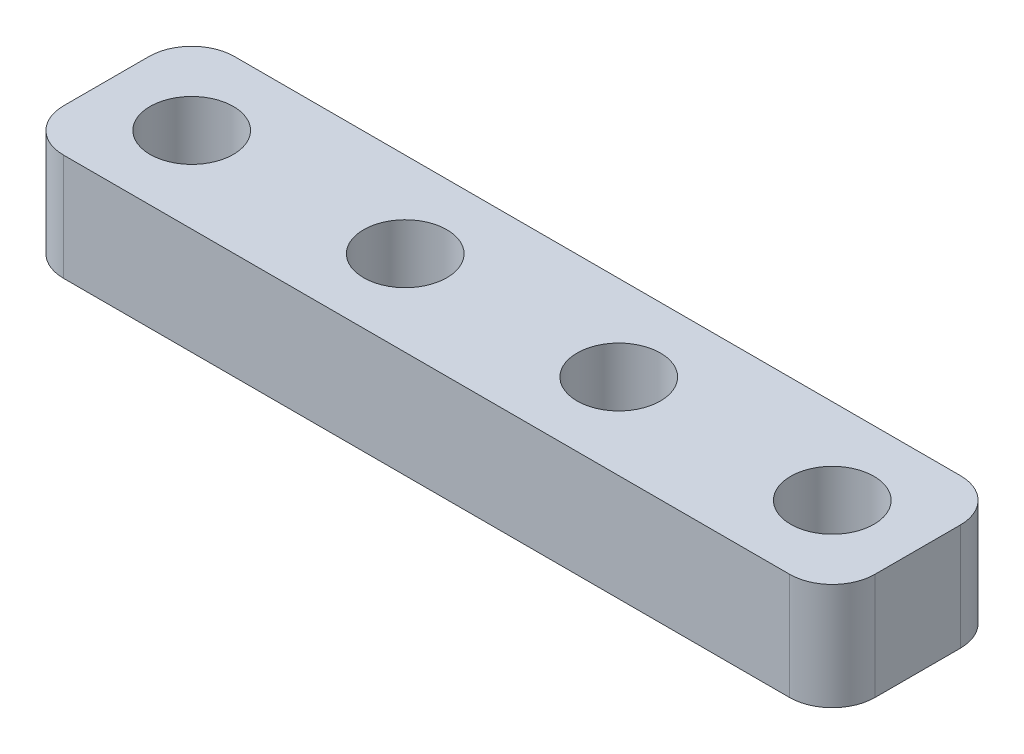
ISO-10303-21;
HEADER;
FILE_DESCRIPTION(('STEP AP214'),'2;1');
FILE_NAME('part.step','',(''),(''),'','','');
FILE_SCHEMA(('AUTOMOTIVE_DESIGN { 1 0 10303 214 1 1 1 1 }'));
ENDSEC;
DATA;
#1=APPLICATION_CONTEXT('core data for automotive mechanical design processes');
#2=APPLICATION_PROTOCOL_DEFINITION('international standard','automotive_design',2000,#1);
#3=PRODUCT_CONTEXT('',#1,'mechanical');
#4=PRODUCT('Part','Part','',(#3));
#5=PRODUCT_RELATED_PRODUCT_CATEGORY('part','',(#4));
#6=PRODUCT_DEFINITION_FORMATION('','',#4);
#7=PRODUCT_DEFINITION_CONTEXT('part definition',#1,'design');
#8=PRODUCT_DEFINITION('design','',#6,#7);
#9=PRODUCT_DEFINITION_SHAPE('','',#8);
#10=(LENGTH_UNIT() NAMED_UNIT(*) SI_UNIT(.MILLI.,.METRE.));
#11=(NAMED_UNIT(*) PLANE_ANGLE_UNIT() SI_UNIT($,.RADIAN.));
#12=(NAMED_UNIT(*) SI_UNIT($,.STERADIAN.) SOLID_ANGLE_UNIT());
#13=UNCERTAINTY_MEASURE_WITH_UNIT(LENGTH_MEASURE(1.E-05),#10,'distance_accuracy_value','');
#14=(GEOMETRIC_REPRESENTATION_CONTEXT(3) GLOBAL_UNCERTAINTY_ASSIGNED_CONTEXT((#13)) GLOBAL_UNIT_ASSIGNED_CONTEXT((#10,
#11,#12)) REPRESENTATION_CONTEXT('',''));
#15=CARTESIAN_POINT('',(0.,0.,0.));
#16=DIRECTION('',(0.,0.,1.));
#17=DIRECTION('',(1.,0.,0.));
#18=AXIS2_PLACEMENT_3D('',#15,#16,#17);
#19=CARTESIAN_POINT('',(36.,5.,6.));
#20=DIRECTION('',(0.,-1.,0.));
#21=DIRECTION('',(0.,0.,-1.));
#22=AXIS2_PLACEMENT_3D('',#19,#20,#21);
#23=CYLINDRICAL_SURFACE('',#22,2.);
#24=CARTESIAN_POINT('',(36.,0.,6.));
#25=DIRECTION('',(0.,1.,0.));
#26=DIRECTION('',(0.,0.,1.));
#27=AXIS2_PLACEMENT_3D('',#24,#25,#26);
#28=CIRCLE('',#27,2.);
#29=CARTESIAN_POINT('',(36.,0.,8.));
#30=VERTEX_POINT('',#29);
#31=CARTESIAN_POINT('',(38.,0.,6.));
#32=VERTEX_POINT('',#31);
#33=EDGE_CURVE('E131',#30,#32,#28,.T.);
#34=ORIENTED_EDGE('',*,*,#33,.T.);
#35=DIRECTION('',(0.,-1.,0.));
#36=VECTOR('',#35,1.);
#37=CARTESIAN_POINT('',(38.,5.,6.));
#38=LINE('',#37,#36);
#39=CARTESIAN_POINT('',(38.,5.,6.));
#40=VERTEX_POINT('',#39);
#41=EDGE_CURVE('E11',#40,#32,#38,.T.);
#42=ORIENTED_EDGE('',*,*,#41,.F.);
#43=CARTESIAN_POINT('',(36.,5.,6.));
#44=DIRECTION('',(0.,1.,0.));
#45=DIRECTION('',(0.,0.,1.));
#46=AXIS2_PLACEMENT_3D('',#43,#44,#45);
#47=CIRCLE('',#46,2.);
#48=CARTESIAN_POINT('',(36.,5.,8.));
#49=VERTEX_POINT('',#48);
#50=EDGE_CURVE('E146',#49,#40,#47,.T.);
#51=ORIENTED_EDGE('',*,*,#50,.F.);
#52=DIRECTION('',(0.,-1.,0.));
#53=VECTOR('',#52,1.);
#54=CARTESIAN_POINT('',(36.,5.,8.));
#55=LINE('',#54,#53);
#56=EDGE_CURVE('E127',#49,#30,#55,.T.);
#57=ORIENTED_EDGE('',*,*,#56,.T.);
#58=EDGE_LOOP('',(#34,#42,#51,#57));
#59=FACE_BOUND('',#58,.T.);
#60=ADVANCED_FACE('F35',(#59),#23,.T.);
#61=CARTESIAN_POINT('',(38.,5.,2.));
#62=DIRECTION('',(-1.,0.,0.));
#63=DIRECTION('',(0.,0.,1.));
#64=AXIS2_PLACEMENT_3D('',#61,#62,#63);
#65=PLANE('',#64);
#66=DIRECTION('',(0.,0.,-1.));
#67=VECTOR('',#66,1.);
#68=CARTESIAN_POINT('',(38.,0.,2.));
#69=LINE('',#68,#67);
#70=CARTESIAN_POINT('',(38.,0.,2.));
#71=VERTEX_POINT('',#70);
#72=EDGE_CURVE('E134',#32,#71,#69,.T.);
#73=ORIENTED_EDGE('',*,*,#72,.T.);
#74=DIRECTION('',(0.,-1.,0.));
#75=VECTOR('',#74,1.);
#76=CARTESIAN_POINT('',(38.,5.,2.));
#77=LINE('',#76,#75);
#78=CARTESIAN_POINT('',(38.,5.,2.));
#79=VERTEX_POINT('',#78);
#80=EDGE_CURVE('E43',#79,#71,#77,.T.);
#81=ORIENTED_EDGE('',*,*,#80,.F.);
#82=DIRECTION('',(0.,0.,-1.));
#83=VECTOR('',#82,1.);
#84=CARTESIAN_POINT('',(38.,5.,2.));
#85=LINE('',#84,#83);
#86=EDGE_CURVE('E94',#40,#79,#85,.T.);
#87=ORIENTED_EDGE('',*,*,#86,.F.);
#88=ORIENTED_EDGE('',*,*,#41,.T.);
#89=EDGE_LOOP('',(#73,#81,#87,#88));
#90=FACE_BOUND('',#89,.T.);
#91=ADVANCED_FACE('F237',(#90),#65,.F.);
#92=CARTESIAN_POINT('',(36.,5.,2.));
#93=DIRECTION('',(0.,-1.,0.));
#94=DIRECTION('',(0.,0.,-1.));
#95=AXIS2_PLACEMENT_3D('',#92,#93,#94);
#96=CYLINDRICAL_SURFACE('',#95,2.);
#97=CARTESIAN_POINT('',(36.,0.,2.));
#98=DIRECTION('',(0.,1.,0.));
#99=DIRECTION('',(0.,0.,-1.));
#100=AXIS2_PLACEMENT_3D('',#97,#98,#99);
#101=CIRCLE('',#100,2.);
#102=CARTESIAN_POINT('',(36.,0.,0.));
#103=VERTEX_POINT('',#102);
#104=EDGE_CURVE('E137',#71,#103,#101,.T.);
#105=ORIENTED_EDGE('',*,*,#104,.T.);
#106=DIRECTION('',(0.,-1.,0.));
#107=VECTOR('',#106,1.);
#108=CARTESIAN_POINT('',(36.,5.,0.));
#109=LINE('',#108,#107);
#110=CARTESIAN_POINT('',(36.,5.,0.));
#111=VERTEX_POINT('',#110);
#112=EDGE_CURVE('E153',#111,#103,#109,.T.);
#113=ORIENTED_EDGE('',*,*,#112,.F.);
#114=CARTESIAN_POINT('',(36.,5.,2.));
#115=DIRECTION('',(0.,1.,0.));
#116=DIRECTION('',(0.,0.,-1.));
#117=AXIS2_PLACEMENT_3D('',#114,#115,#116);
#118=CIRCLE('',#117,2.);
#119=EDGE_CURVE('E161',#79,#111,#118,.T.);
#120=ORIENTED_EDGE('',*,*,#119,.F.);
#121=ORIENTED_EDGE('',*,*,#80,.T.);
#122=EDGE_LOOP('',(#105,#113,#120,#121));
#123=FACE_BOUND('',#122,.T.);
#124=ADVANCED_FACE('F159',(#123),#96,.T.);
#125=CARTESIAN_POINT('',(2.00000000000001,5.,0.));
#126=DIRECTION('',(0.,0.,1.));
#127=DIRECTION('',(1.,0.,0.));
#128=AXIS2_PLACEMENT_3D('',#125,#126,#127);
#129=PLANE('',#128);
#130=DIRECTION('',(-1.,0.,0.));
#131=VECTOR('',#130,1.);
#132=CARTESIAN_POINT('',(2.00000000000001,0.,0.));
#133=LINE('',#132,#131);
#134=CARTESIAN_POINT('',(2.00000000000001,0.,0.));
#135=VERTEX_POINT('',#134);
#136=EDGE_CURVE('E139',#103,#135,#133,.T.);
#137=ORIENTED_EDGE('',*,*,#136,.T.);
#138=DIRECTION('',(0.,-1.,0.));
#139=VECTOR('',#138,1.);
#140=CARTESIAN_POINT('',(2.00000000000001,5.,0.));
#141=LINE('',#140,#139);
#142=CARTESIAN_POINT('',(2.00000000000001,5.,0.));
#143=VERTEX_POINT('',#142);
#144=EDGE_CURVE('E150',#143,#135,#141,.T.);
#145=ORIENTED_EDGE('',*,*,#144,.F.);
#146=DIRECTION('',(-1.,0.,0.));
#147=VECTOR('',#146,1.);
#148=CARTESIAN_POINT('',(2.00000000000001,5.,0.));
#149=LINE('',#148,#147);
#150=EDGE_CURVE('E173',#111,#143,#149,.T.);
#151=ORIENTED_EDGE('',*,*,#150,.F.);
#152=ORIENTED_EDGE('',*,*,#112,.T.);
#153=EDGE_LOOP('',(#137,#145,#151,#152));
#154=FACE_BOUND('',#153,.T.);
#155=ADVANCED_FACE('F169',(#154),#129,.F.);
#156=CARTESIAN_POINT('',(2.,5.,2.));
#157=DIRECTION('',(0.,-1.,0.));
#158=DIRECTION('',(0.,0.,-1.));
#159=AXIS2_PLACEMENT_3D('',#156,#157,#158);
#160=CYLINDRICAL_SURFACE('',#159,2.);
#161=CARTESIAN_POINT('',(2.,0.,2.));
#162=DIRECTION('',(0.,1.,0.));
#163=DIRECTION('',(0.,0.,1.));
#164=AXIS2_PLACEMENT_3D('',#161,#162,#163);
#165=CIRCLE('',#164,2.);
#166=CARTESIAN_POINT('',(0.,0.,2.00000000000001));
#167=VERTEX_POINT('',#166);
#168=EDGE_CURVE('E141',#135,#167,#165,.T.);
#169=ORIENTED_EDGE('',*,*,#168,.T.);
#170=DIRECTION('',(0.,-1.,0.));
#171=VECTOR('',#170,1.);
#172=CARTESIAN_POINT('',(0.,5.,2.00000000000001));
#173=LINE('',#172,#171);
#174=CARTESIAN_POINT('',(0.,5.,2.00000000000001));
#175=VERTEX_POINT('',#174);
#176=EDGE_CURVE('E122',#175,#167,#173,.T.);
#177=ORIENTED_EDGE('',*,*,#176,.F.);
#178=CARTESIAN_POINT('',(2.,5.,2.));
#179=DIRECTION('',(0.,1.,0.));
#180=DIRECTION('',(0.,0.,1.));
#181=AXIS2_PLACEMENT_3D('',#178,#179,#180);
#182=CIRCLE('',#181,2.);
#183=EDGE_CURVE('E113',#143,#175,#182,.T.);
#184=ORIENTED_EDGE('',*,*,#183,.F.);
#185=ORIENTED_EDGE('',*,*,#144,.T.);
#186=EDGE_LOOP('',(#169,#177,#184,#185));
#187=FACE_BOUND('',#186,.T.);
#188=ADVANCED_FACE('F172',(#187),#160,.T.);
#189=CARTESIAN_POINT('',(0.,5.,2.00000000000001));
#190=DIRECTION('',(1.,0.,0.));
#191=DIRECTION('',(0.,0.,-1.));
#192=AXIS2_PLACEMENT_3D('',#189,#190,#191);
#193=PLANE('',#192);
#194=DIRECTION('',(0.,0.,1.));
#195=VECTOR('',#194,1.);
#196=CARTESIAN_POINT('',(0.,0.,2.00000000000001));
#197=LINE('',#196,#195);
#198=CARTESIAN_POINT('',(0.,0.,6.));
#199=VERTEX_POINT('',#198);
#200=EDGE_CURVE('E121',#167,#199,#197,.T.);
#201=ORIENTED_EDGE('',*,*,#200,.T.);
#202=DIRECTION('',(0.,-1.,0.));
#203=VECTOR('',#202,1.);
#204=CARTESIAN_POINT('',(0.,5.,6.));
#205=LINE('',#204,#203);
#206=CARTESIAN_POINT('',(0.,5.,6.));
#207=VERTEX_POINT('',#206);
#208=EDGE_CURVE('E118',#207,#199,#205,.T.);
#209=ORIENTED_EDGE('',*,*,#208,.F.);
#210=DIRECTION('',(0.,0.,1.));
#211=VECTOR('',#210,1.);
#212=CARTESIAN_POINT('',(0.,5.,2.00000000000001));
#213=LINE('',#212,#211);
#214=EDGE_CURVE('E107',#175,#207,#213,.T.);
#215=ORIENTED_EDGE('',*,*,#214,.F.);
#216=ORIENTED_EDGE('',*,*,#176,.T.);
#217=EDGE_LOOP('',(#201,#209,#215,#216));
#218=FACE_BOUND('',#217,.T.);
#219=ADVANCED_FACE('F119',(#218),#193,.F.);
#220=CARTESIAN_POINT('',(2.,5.,6.));
#221=DIRECTION('',(0.,-1.,0.));
#222=DIRECTION('',(0.,0.,-1.));
#223=AXIS2_PLACEMENT_3D('',#220,#221,#222);
#224=CYLINDRICAL_SURFACE('',#223,2.);
#225=CARTESIAN_POINT('',(2.,0.,6.));
#226=DIRECTION('',(0.,1.,0.));
#227=DIRECTION('',(0.,0.,1.));
#228=AXIS2_PLACEMENT_3D('',#225,#226,#227);
#229=CIRCLE('',#228,2.);
#230=CARTESIAN_POINT('',(2.,0.,8.));
#231=VERTEX_POINT('',#230);
#232=EDGE_CURVE('E80',#199,#231,#229,.T.);
#233=ORIENTED_EDGE('',*,*,#232,.T.);
#234=DIRECTION('',(0.,-1.,0.));
#235=VECTOR('',#234,1.);
#236=CARTESIAN_POINT('',(2.,5.,8.));
#237=LINE('',#236,#235);
#238=CARTESIAN_POINT('',(2.,5.,8.));
#239=VERTEX_POINT('',#238);
#240=EDGE_CURVE('E123',#239,#231,#237,.T.);
#241=ORIENTED_EDGE('',*,*,#240,.F.);
#242=CARTESIAN_POINT('',(2.,5.,6.));
#243=DIRECTION('',(0.,1.,0.));
#244=DIRECTION('',(0.,0.,1.));
#245=AXIS2_PLACEMENT_3D('',#242,#243,#244);
#246=CIRCLE('',#245,2.);
#247=EDGE_CURVE('E111',#207,#239,#246,.T.);
#248=ORIENTED_EDGE('',*,*,#247,.F.);
#249=ORIENTED_EDGE('',*,*,#208,.T.);
#250=EDGE_LOOP('',(#233,#241,#248,#249));
#251=FACE_BOUND('',#250,.T.);
#252=ADVANCED_FACE('F125',(#251),#224,.T.);
#253=CARTESIAN_POINT('',(2.,5.,8.));
#254=DIRECTION('',(0.,0.,-1.));
#255=DIRECTION('',(-1.,0.,0.));
#256=AXIS2_PLACEMENT_3D('',#253,#254,#255);
#257=PLANE('',#256);
#258=DIRECTION('',(1.,0.,0.));
#259=VECTOR('',#258,1.);
#260=CARTESIAN_POINT('',(2.,0.,8.));
#261=LINE('',#260,#259);
#262=EDGE_CURVE('E86',#231,#30,#261,.T.);
#263=ORIENTED_EDGE('',*,*,#262,.T.);
#264=ORIENTED_EDGE('',*,*,#56,.F.);
#265=DIRECTION('',(1.,0.,0.));
#266=VECTOR('',#265,1.);
#267=CARTESIAN_POINT('',(2.,5.,8.));
#268=LINE('',#267,#266);
#269=EDGE_CURVE('E51',#239,#49,#268,.T.);
#270=ORIENTED_EDGE('',*,*,#269,.F.);
#271=ORIENTED_EDGE('',*,*,#240,.T.);
#272=EDGE_LOOP('',(#263,#264,#270,#271));
#273=FACE_BOUND('',#272,.T.);
#274=ADVANCED_FACE('F214',(#273),#257,.F.);
#275=CARTESIAN_POINT('',(36.,5.,6.));
#276=DIRECTION('',(0.,1.,0.));
#277=DIRECTION('',(0.,0.,1.));
#278=AXIS2_PLACEMENT_3D('',#275,#276,#277);
#279=PLANE('',#278);
#280=CARTESIAN_POINT('',(34.,5.,3.99999999999999));
#281=DIRECTION('',(0.,1.,0.));
#282=DIRECTION('',(0.,0.,1.));
#283=AXIS2_PLACEMENT_3D('',#280,#281,#282);
#284=CIRCLE('',#283,1.95);
#285=CARTESIAN_POINT('',(34.,5.,5.94999999999999));
#286=VERTEX_POINT('',#285);
#287=EDGE_CURVE('E192',#286,#286,#284,.T.);
#288=ORIENTED_EDGE('',*,*,#287,.F.);
#289=EDGE_LOOP('',(#288));
#290=FACE_BOUND('',#289,.T.);
#291=CARTESIAN_POINT('',(4.,5.,4.));
#292=DIRECTION('',(0.,1.,0.));
#293=DIRECTION('',(0.,0.,1.));
#294=AXIS2_PLACEMENT_3D('',#291,#292,#293);
#295=CIRCLE('',#294,1.95);
#296=CARTESIAN_POINT('',(4.,5.,5.95));
#297=VERTEX_POINT('',#296);
#298=EDGE_CURVE('E193',#297,#297,#295,.T.);
#299=ORIENTED_EDGE('',*,*,#298,.F.);
#300=EDGE_LOOP('',(#299));
#301=FACE_BOUND('',#300,.T.);
#302=CARTESIAN_POINT('',(14.,5.,4.));
#303=DIRECTION('',(0.,1.,0.));
#304=DIRECTION('',(0.,0.,1.));
#305=AXIS2_PLACEMENT_3D('',#302,#303,#304);
#306=CIRCLE('',#305,1.95);
#307=CARTESIAN_POINT('',(14.,5.,5.94999999999999));
#308=VERTEX_POINT('',#307);
#309=EDGE_CURVE('E179',#308,#308,#306,.T.);
#310=ORIENTED_EDGE('',*,*,#309,.F.);
#311=EDGE_LOOP('',(#310));
#312=FACE_BOUND('',#311,.T.);
#313=CARTESIAN_POINT('',(24.,5.,3.99999999999999));
#314=DIRECTION('',(0.,1.,0.));
#315=DIRECTION('',(0.,0.,1.));
#316=AXIS2_PLACEMENT_3D('',#313,#314,#315);
#317=CIRCLE('',#316,1.95);
#318=CARTESIAN_POINT('',(24.,5.,5.94999999999999));
#319=VERTEX_POINT('',#318);
#320=EDGE_CURVE('E186',#319,#319,#317,.T.);
#321=ORIENTED_EDGE('',*,*,#320,.F.);
#322=EDGE_LOOP('',(#321));
#323=FACE_BOUND('',#322,.T.);
#324=ORIENTED_EDGE('',*,*,#50,.T.);
#325=ORIENTED_EDGE('',*,*,#86,.T.);
#326=ORIENTED_EDGE('',*,*,#119,.T.);
#327=ORIENTED_EDGE('',*,*,#150,.T.);
#328=ORIENTED_EDGE('',*,*,#183,.T.);
#329=ORIENTED_EDGE('',*,*,#214,.T.);
#330=ORIENTED_EDGE('',*,*,#247,.T.);
#331=ORIENTED_EDGE('',*,*,#269,.T.);
#332=EDGE_LOOP('',(#324,#325,#326,#327,#328,#329,#330,#331));
#333=FACE_BOUND('',#332,.T.);
#334=ADVANCED_FACE('F109',(#290,#301,#312,#323,#333),#279,.T.);
#335=CARTESIAN_POINT('',(36.,0.,6.));
#336=DIRECTION('',(0.,1.,0.));
#337=DIRECTION('',(0.,0.,1.));
#338=AXIS2_PLACEMENT_3D('',#335,#336,#337);
#339=PLANE('',#338);
#340=CARTESIAN_POINT('',(34.,0.,3.99999999999999));
#341=DIRECTION('',(0.,1.,0.));
#342=DIRECTION('',(0.,0.,1.));
#343=AXIS2_PLACEMENT_3D('',#340,#341,#342);
#344=CIRCLE('',#343,1.95);
#345=CARTESIAN_POINT('',(34.,0.,5.94999999999999));
#346=VERTEX_POINT('',#345);
#347=EDGE_CURVE('E135',#346,#346,#344,.T.);
#348=ORIENTED_EDGE('',*,*,#347,.T.);
#349=EDGE_LOOP('',(#348));
#350=FACE_BOUND('',#349,.T.);
#351=CARTESIAN_POINT('',(4.,0.,4.));
#352=DIRECTION('',(0.,1.,0.));
#353=DIRECTION('',(0.,0.,1.));
#354=AXIS2_PLACEMENT_3D('',#351,#352,#353);
#355=CIRCLE('',#354,1.95);
#356=CARTESIAN_POINT('',(4.,0.,5.95));
#357=VERTEX_POINT('',#356);
#358=EDGE_CURVE('E183',#357,#357,#355,.T.);
#359=ORIENTED_EDGE('',*,*,#358,.T.);
#360=EDGE_LOOP('',(#359));
#361=FACE_BOUND('',#360,.T.);
#362=CARTESIAN_POINT('',(14.,0.,4.));
#363=DIRECTION('',(0.,1.,0.));
#364=DIRECTION('',(0.,0.,1.));
#365=AXIS2_PLACEMENT_3D('',#362,#363,#364);
#366=CIRCLE('',#365,1.95);
#367=CARTESIAN_POINT('',(14.,0.,5.94999999999999));
#368=VERTEX_POINT('',#367);
#369=EDGE_CURVE('E182',#368,#368,#366,.T.);
#370=ORIENTED_EDGE('',*,*,#369,.T.);
#371=EDGE_LOOP('',(#370));
#372=FACE_BOUND('',#371,.T.);
#373=CARTESIAN_POINT('',(24.,0.,3.99999999999999));
#374=DIRECTION('',(0.,1.,0.));
#375=DIRECTION('',(0.,0.,1.));
#376=AXIS2_PLACEMENT_3D('',#373,#374,#375);
#377=CIRCLE('',#376,1.95);
#378=CARTESIAN_POINT('',(24.,0.,5.94999999999999));
#379=VERTEX_POINT('',#378);
#380=EDGE_CURVE('E189',#379,#379,#377,.T.);
#381=ORIENTED_EDGE('',*,*,#380,.T.);
#382=EDGE_LOOP('',(#381));
#383=FACE_BOUND('',#382,.T.);
#384=ORIENTED_EDGE('',*,*,#33,.F.);
#385=ORIENTED_EDGE('',*,*,#262,.F.);
#386=ORIENTED_EDGE('',*,*,#232,.F.);
#387=ORIENTED_EDGE('',*,*,#200,.F.);
#388=ORIENTED_EDGE('',*,*,#168,.F.);
#389=ORIENTED_EDGE('',*,*,#136,.F.);
#390=ORIENTED_EDGE('',*,*,#104,.F.);
#391=ORIENTED_EDGE('',*,*,#72,.F.);
#392=EDGE_LOOP('',(#384,#385,#386,#387,#388,#389,#390,#391));
#393=FACE_BOUND('',#392,.T.);
#394=ADVANCED_FACE('F165',(#350,#361,#372,#383,#393),#339,.F.);
#395=CARTESIAN_POINT('',(24.,0.,3.99999999999999));
#396=DIRECTION('',(0.,1.,0.));
#397=DIRECTION('',(0.,0.,1.));
#398=AXIS2_PLACEMENT_3D('',#395,#396,#397);
#399=CYLINDRICAL_SURFACE('',#398,1.95);
#400=ORIENTED_EDGE('',*,*,#380,.F.);
#401=EDGE_LOOP('',(#400));
#402=FACE_BOUND('',#401,.T.);
#403=ORIENTED_EDGE('',*,*,#320,.T.);
#404=EDGE_LOOP('',(#403));
#405=FACE_BOUND('',#404,.T.);
#406=ADVANCED_FACE('F222',(#402,#405),#399,.F.);
#407=CARTESIAN_POINT('',(14.,0.,4.));
#408=DIRECTION('',(0.,1.,0.));
#409=DIRECTION('',(0.,0.,1.));
#410=AXIS2_PLACEMENT_3D('',#407,#408,#409);
#411=CYLINDRICAL_SURFACE('',#410,1.95);
#412=ORIENTED_EDGE('',*,*,#369,.F.);
#413=EDGE_LOOP('',(#412));
#414=FACE_BOUND('',#413,.T.);
#415=ORIENTED_EDGE('',*,*,#309,.T.);
#416=EDGE_LOOP('',(#415));
#417=FACE_BOUND('',#416,.T.);
#418=ADVANCED_FACE('F224',(#414,#417),#411,.F.);
#419=CARTESIAN_POINT('',(4.,0.,4.));
#420=DIRECTION('',(0.,1.,0.));
#421=DIRECTION('',(0.,0.,1.));
#422=AXIS2_PLACEMENT_3D('',#419,#420,#421);
#423=CYLINDRICAL_SURFACE('',#422,1.95);
#424=ORIENTED_EDGE('',*,*,#358,.F.);
#425=EDGE_LOOP('',(#424));
#426=FACE_BOUND('',#425,.T.);
#427=ORIENTED_EDGE('',*,*,#298,.T.);
#428=EDGE_LOOP('',(#427));
#429=FACE_BOUND('',#428,.T.);
#430=ADVANCED_FACE('F208',(#426,#429),#423,.F.);
#431=CARTESIAN_POINT('',(34.,0.,3.99999999999999));
#432=DIRECTION('',(0.,1.,0.));
#433=DIRECTION('',(0.,0.,1.));
#434=AXIS2_PLACEMENT_3D('',#431,#432,#433);
#435=CYLINDRICAL_SURFACE('',#434,1.95);
#436=ORIENTED_EDGE('',*,*,#347,.F.);
#437=EDGE_LOOP('',(#436));
#438=FACE_BOUND('',#437,.T.);
#439=ORIENTED_EDGE('',*,*,#287,.T.);
#440=EDGE_LOOP('',(#439));
#441=FACE_BOUND('',#440,.T.);
#442=ADVANCED_FACE('F205',(#438,#441),#435,.F.);
#443=CLOSED_SHELL('',(#60,#91,#124,#155,#188,#219,#252,#274,#334,#394,#406,#418,#430,#442));
#444=MANIFOLD_SOLID_BREP('B2',#443);
#445=ADVANCED_BREP_SHAPE_REPRESENTATION('',(#18,#444),#14);
#446=SHAPE_DEFINITION_REPRESENTATION(#9,#445);
ENDSEC;
END-ISO-10303-21;
